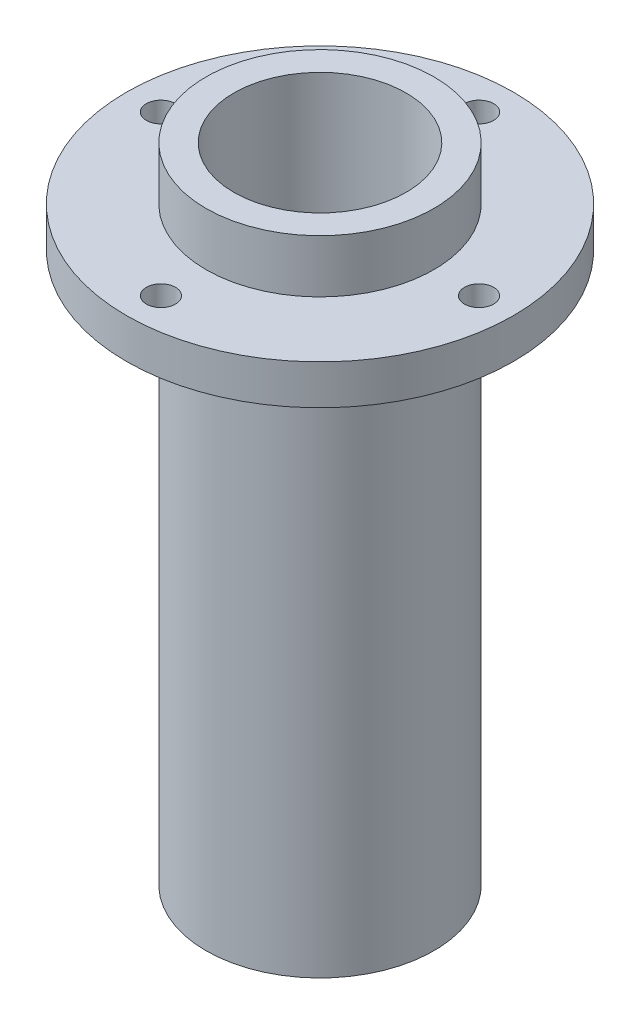
ISO-10303-21;
HEADER;
FILE_DESCRIPTION(('STEP AP214'),'2;1');
FILE_NAME('part.step','',(''),(''),'','','');
FILE_SCHEMA(('AUTOMOTIVE_DESIGN { 1 0 10303 214 1 1 1 1 }'));
ENDSEC;
DATA;
#1=APPLICATION_CONTEXT('core data for automotive mechanical design processes');
#2=APPLICATION_PROTOCOL_DEFINITION('international standard','automotive_design',2000,#1);
#3=PRODUCT_CONTEXT('',#1,'mechanical');
#4=PRODUCT('Part','Part','',(#3));
#5=PRODUCT_RELATED_PRODUCT_CATEGORY('part','',(#4));
#6=PRODUCT_DEFINITION_FORMATION('','',#4);
#7=PRODUCT_DEFINITION_CONTEXT('part definition',#1,'design');
#8=PRODUCT_DEFINITION('design','',#6,#7);
#9=PRODUCT_DEFINITION_SHAPE('','',#8);
#10=(LENGTH_UNIT() NAMED_UNIT(*) SI_UNIT(.MILLI.,.METRE.));
#11=(NAMED_UNIT(*) PLANE_ANGLE_UNIT() SI_UNIT($,.RADIAN.));
#12=(NAMED_UNIT(*) SI_UNIT($,.STERADIAN.) SOLID_ANGLE_UNIT());
#13=UNCERTAINTY_MEASURE_WITH_UNIT(LENGTH_MEASURE(1.E-05),#10,'distance_accuracy_value','');
#14=(GEOMETRIC_REPRESENTATION_CONTEXT(3) GLOBAL_UNCERTAINTY_ASSIGNED_CONTEXT((#13)) GLOBAL_UNIT_ASSIGNED_CONTEXT((#10,
#11,#12)) REPRESENTATION_CONTEXT('',''));
#15=CARTESIAN_POINT('',(0.,0.,0.));
#16=DIRECTION('',(0.,0.,1.));
#17=DIRECTION('',(1.,0.,0.));
#18=AXIS2_PLACEMENT_3D('',#15,#16,#17);
#19=CARTESIAN_POINT('',(0.,20.75,0.));
#20=DIRECTION('',(0.,1.,0.));
#21=DIRECTION('',(0.,0.,1.));
#22=AXIS2_PLACEMENT_3D('',#19,#20,#21);
#23=CYLINDRICAL_SURFACE('',#22,8.6);
#24=CARTESIAN_POINT('',(0.,16.75,0.));
#25=DIRECTION('',(0.,1.,0.));
#26=DIRECTION('',(0.,0.,1.));
#27=AXIS2_PLACEMENT_3D('',#24,#25,#26);
#28=CIRCLE('',#27,8.6);
#29=CARTESIAN_POINT('',(0.,16.75,8.6));
#30=VERTEX_POINT('',#29);
#31=EDGE_CURVE('E50',#30,#30,#28,.T.);
#32=ORIENTED_EDGE('',*,*,#31,.T.);
#33=EDGE_LOOP('',(#32));
#34=FACE_BOUND('',#33,.T.);
#35=CARTESIAN_POINT('',(0.,20.75,0.));
#36=DIRECTION('',(0.,1.,0.));
#37=DIRECTION('',(0.,0.,1.));
#38=AXIS2_PLACEMENT_3D('',#35,#36,#37);
#39=CIRCLE('',#38,8.6);
#40=CARTESIAN_POINT('',(0.,20.75,8.6));
#41=VERTEX_POINT('',#40);
#42=EDGE_CURVE('E77',#41,#41,#39,.T.);
#43=ORIENTED_EDGE('',*,*,#42,.F.);
#44=EDGE_LOOP('',(#43));
#45=FACE_BOUND('',#44,.T.);
#46=ADVANCED_FACE('F37',(#34,#45),#23,.T.);
#47=CARTESIAN_POINT('',(-14.6,16.75,0.));
#48=DIRECTION('',(0.,1.,0.));
#49=DIRECTION('',(0.,0.,1.));
#50=AXIS2_PLACEMENT_3D('',#47,#48,#49);
#51=PLANE('',#50);
#52=CARTESIAN_POINT('',(0.,16.75,-12.));
#53=DIRECTION('',(0.,1.,0.));
#54=DIRECTION('',(0.,0.,1.));
#55=AXIS2_PLACEMENT_3D('',#52,#53,#54);
#56=CIRCLE('',#55,1.1);
#57=CARTESIAN_POINT('',(0.,16.75,-10.9));
#58=VERTEX_POINT('',#57);
#59=EDGE_CURVE('E81',#58,#58,#56,.T.);
#60=ORIENTED_EDGE('',*,*,#59,.F.);
#61=EDGE_LOOP('',(#60));
#62=FACE_BOUND('',#61,.T.);
#63=CARTESIAN_POINT('',(12.0000000000008,16.75,-7.65792580530817E-13));
#64=DIRECTION('',(0.,1.,0.));
#65=DIRECTION('',(0.,0.,1.));
#66=AXIS2_PLACEMENT_3D('',#63,#64,#65);
#67=CIRCLE('',#66,1.1);
#68=CARTESIAN_POINT('',(12.0000000000008,16.75,1.09999999999924));
#69=VERTEX_POINT('',#68);
#70=EDGE_CURVE('E103',#69,#69,#67,.T.);
#71=ORIENTED_EDGE('',*,*,#70,.F.);
#72=EDGE_LOOP('',(#71));
#73=FACE_BOUND('',#72,.T.);
#74=CARTESIAN_POINT('',(1.53207728676303E-12,16.75,12.));
#75=DIRECTION('',(0.,1.,0.));
#76=DIRECTION('',(0.,0.,1.));
#77=AXIS2_PLACEMENT_3D('',#74,#75,#76);
#78=CIRCLE('',#77,1.1);
#79=CARTESIAN_POINT('',(1.53207728676303E-12,16.75,13.1));
#80=VERTEX_POINT('',#79);
#81=EDGE_CURVE('E95',#80,#80,#78,.T.);
#82=ORIENTED_EDGE('',*,*,#81,.F.);
#83=EDGE_LOOP('',(#82));
#84=FACE_BOUND('',#83,.T.);
#85=CARTESIAN_POINT('',(-11.9999999999992,16.75,7.67262156689794E-13));
#86=DIRECTION('',(0.,1.,0.));
#87=DIRECTION('',(0.,0.,1.));
#88=AXIS2_PLACEMENT_3D('',#85,#86,#87);
#89=CIRCLE('',#88,1.1);
#90=CARTESIAN_POINT('',(-11.9999999999992,16.75,1.10000000000077));
#91=VERTEX_POINT('',#90);
#92=EDGE_CURVE('E86',#91,#91,#89,.T.);
#93=ORIENTED_EDGE('',*,*,#92,.F.);
#94=EDGE_LOOP('',(#93));
#95=FACE_BOUND('',#94,.T.);
#96=CARTESIAN_POINT('',(0.,16.75,0.));
#97=DIRECTION('',(0.,1.,0.));
#98=DIRECTION('',(0.,0.,1.));
#99=AXIS2_PLACEMENT_3D('',#96,#97,#98);
#100=CIRCLE('',#99,14.6);
#101=CARTESIAN_POINT('',(0.,16.75,14.6));
#102=VERTEX_POINT('',#101);
#103=EDGE_CURVE('E55',#102,#102,#100,.T.);
#104=ORIENTED_EDGE('',*,*,#103,.T.);
#105=EDGE_LOOP('',(#104));
#106=FACE_BOUND('',#105,.T.);
#107=ORIENTED_EDGE('',*,*,#31,.F.);
#108=EDGE_LOOP('',(#107));
#109=FACE_BOUND('',#108,.T.);
#110=ADVANCED_FACE('F139',(#62,#73,#84,#95,#106,#109),#51,.T.);
#111=CARTESIAN_POINT('',(0.,20.75,0.));
#112=DIRECTION('',(0.,1.,0.));
#113=DIRECTION('',(0.,0.,1.));
#114=AXIS2_PLACEMENT_3D('',#111,#112,#113);
#115=CYLINDRICAL_SURFACE('',#114,14.6);
#116=CARTESIAN_POINT('',(0.,13.75,0.));
#117=DIRECTION('',(0.,1.,0.));
#118=DIRECTION('',(0.,0.,1.));
#119=AXIS2_PLACEMENT_3D('',#116,#117,#118);
#120=CIRCLE('',#119,14.6);
#121=CARTESIAN_POINT('',(0.,13.75,14.6));
#122=VERTEX_POINT('',#121);
#123=EDGE_CURVE('E61',#122,#122,#120,.T.);
#124=ORIENTED_EDGE('',*,*,#123,.T.);
#125=EDGE_LOOP('',(#124));
#126=FACE_BOUND('',#125,.T.);
#127=ORIENTED_EDGE('',*,*,#103,.F.);
#128=EDGE_LOOP('',(#127));
#129=FACE_BOUND('',#128,.T.);
#130=ADVANCED_FACE('F144',(#126,#129),#115,.T.);
#131=CARTESIAN_POINT('',(-14.6,13.75,0.));
#132=DIRECTION('',(0.,-1.,0.));
#133=DIRECTION('',(0.,0.,-1.));
#134=AXIS2_PLACEMENT_3D('',#131,#132,#133);
#135=PLANE('',#134);
#136=CARTESIAN_POINT('',(0.,13.75,-12.));
#137=DIRECTION('',(0.,-1.,0.));
#138=DIRECTION('',(0.,0.,-1.));
#139=AXIS2_PLACEMENT_3D('',#136,#137,#138);
#140=CIRCLE('',#139,1.1);
#141=CARTESIAN_POINT('',(0.,13.75,-13.1));
#142=VERTEX_POINT('',#141);
#143=EDGE_CURVE('E107',#142,#142,#140,.F.);
#144=ORIENTED_EDGE('',*,*,#143,.T.);
#145=EDGE_LOOP('',(#144));
#146=FACE_BOUND('',#145,.T.);
#147=CARTESIAN_POINT('',(12.0000000000008,13.75,-7.65792580530817E-13));
#148=DIRECTION('',(0.,-1.,0.));
#149=DIRECTION('',(0.,0.,-1.));
#150=AXIS2_PLACEMENT_3D('',#147,#148,#149);
#151=CIRCLE('',#150,1.1);
#152=CARTESIAN_POINT('',(12.0000000000008,13.75,-1.10000000000077));
#153=VERTEX_POINT('',#152);
#154=EDGE_CURVE('E99',#153,#153,#151,.F.);
#155=ORIENTED_EDGE('',*,*,#154,.T.);
#156=EDGE_LOOP('',(#155));
#157=FACE_BOUND('',#156,.T.);
#158=CARTESIAN_POINT('',(1.53207728676303E-12,13.75,12.));
#159=DIRECTION('',(0.,-1.,0.));
#160=DIRECTION('',(0.,0.,-1.));
#161=AXIS2_PLACEMENT_3D('',#158,#159,#160);
#162=CIRCLE('',#161,1.1);
#163=CARTESIAN_POINT('',(1.53207728676303E-12,13.75,10.9));
#164=VERTEX_POINT('',#163);
#165=EDGE_CURVE('E91',#164,#164,#162,.F.);
#166=ORIENTED_EDGE('',*,*,#165,.T.);
#167=EDGE_LOOP('',(#166));
#168=FACE_BOUND('',#167,.T.);
#169=CARTESIAN_POINT('',(-11.9999999999992,13.75,7.67262156689794E-13));
#170=DIRECTION('',(0.,-1.,0.));
#171=DIRECTION('',(0.,0.,-1.));
#172=AXIS2_PLACEMENT_3D('',#169,#170,#171);
#173=CIRCLE('',#172,1.1);
#174=CARTESIAN_POINT('',(-11.9999999999992,13.75,-1.09999999999923));
#175=VERTEX_POINT('',#174);
#176=EDGE_CURVE('E82',#175,#175,#173,.F.);
#177=ORIENTED_EDGE('',*,*,#176,.T.);
#178=EDGE_LOOP('',(#177));
#179=FACE_BOUND('',#178,.T.);
#180=CARTESIAN_POINT('',(0.,13.75,0.));
#181=DIRECTION('',(0.,1.,0.));
#182=DIRECTION('',(0.,0.,1.));
#183=AXIS2_PLACEMENT_3D('',#180,#181,#182);
#184=CIRCLE('',#183,8.6);
#185=CARTESIAN_POINT('',(0.,13.75,8.6));
#186=VERTEX_POINT('',#185);
#187=EDGE_CURVE('E65',#186,#186,#184,.T.);
#188=ORIENTED_EDGE('',*,*,#187,.T.);
#189=EDGE_LOOP('',(#188));
#190=FACE_BOUND('',#189,.T.);
#191=ORIENTED_EDGE('',*,*,#123,.F.);
#192=EDGE_LOOP('',(#191));
#193=FACE_BOUND('',#192,.T.);
#194=ADVANCED_FACE('F150',(#146,#157,#168,#179,#190,#193),#135,.T.);
#195=CARTESIAN_POINT('',(0.,20.75,0.));
#196=DIRECTION('',(0.,1.,0.));
#197=DIRECTION('',(0.,0.,1.));
#198=AXIS2_PLACEMENT_3D('',#195,#196,#197);
#199=CYLINDRICAL_SURFACE('',#198,8.6);
#200=CARTESIAN_POINT('',(0.,-27.75,0.));
#201=DIRECTION('',(0.,1.,0.));
#202=DIRECTION('',(0.,0.,1.));
#203=AXIS2_PLACEMENT_3D('',#200,#201,#202);
#204=CIRCLE('',#203,8.6);
#205=CARTESIAN_POINT('',(0.,-27.75,8.6));
#206=VERTEX_POINT('',#205);
#207=EDGE_CURVE('E69',#206,#206,#204,.T.);
#208=ORIENTED_EDGE('',*,*,#207,.T.);
#209=EDGE_LOOP('',(#208));
#210=FACE_BOUND('',#209,.T.);
#211=ORIENTED_EDGE('',*,*,#187,.F.);
#212=EDGE_LOOP('',(#211));
#213=FACE_BOUND('',#212,.T.);
#214=ADVANCED_FACE('F154',(#210,#213),#199,.T.);
#215=CARTESIAN_POINT('',(-6.6,-27.75,0.));
#216=DIRECTION('',(0.,-1.,0.));
#217=DIRECTION('',(0.,0.,-1.));
#218=AXIS2_PLACEMENT_3D('',#215,#216,#217);
#219=PLANE('',#218);
#220=CARTESIAN_POINT('',(0.,-27.75,0.));
#221=DIRECTION('',(0.,-1.,0.));
#222=DIRECTION('',(0.,0.,-1.));
#223=AXIS2_PLACEMENT_3D('',#220,#221,#222);
#224=CIRCLE('',#223,7.1);
#225=CARTESIAN_POINT('',(0.,-27.75,-7.1));
#226=VERTEX_POINT('',#225);
#227=EDGE_CURVE('E45',#226,#226,#224,.F.);
#228=ORIENTED_EDGE('',*,*,#227,.T.);
#229=EDGE_LOOP('',(#228));
#230=FACE_BOUND('',#229,.T.);
#231=ORIENTED_EDGE('',*,*,#207,.F.);
#232=EDGE_LOOP('',(#231));
#233=FACE_BOUND('',#232,.T.);
#234=ADVANCED_FACE('F158',(#230,#233),#219,.T.);
#235=CARTESIAN_POINT('',(0.,20.75,0.));
#236=DIRECTION('',(0.,1.,0.));
#237=DIRECTION('',(0.,0.,1.));
#238=AXIS2_PLACEMENT_3D('',#235,#236,#237);
#239=CYLINDRICAL_SURFACE('',#238,6.6);
#240=CARTESIAN_POINT('',(0.,-27.25,0.));
#241=DIRECTION('',(0.,-1.,0.));
#242=DIRECTION('',(0.,0.,-1.));
#243=AXIS2_PLACEMENT_3D('',#240,#241,#242);
#244=CIRCLE('',#243,6.6);
#245=CARTESIAN_POINT('',(0.,-27.25,-6.6));
#246=VERTEX_POINT('',#245);
#247=EDGE_CURVE('E10',#246,#246,#244,.T.);
#248=ORIENTED_EDGE('',*,*,#247,.T.);
#249=EDGE_LOOP('',(#248));
#250=FACE_BOUND('',#249,.T.);
#251=CARTESIAN_POINT('',(0.,-20.75,0.));
#252=DIRECTION('',(0.,1.,0.));
#253=DIRECTION('',(0.,0.,1.));
#254=AXIS2_PLACEMENT_3D('',#251,#252,#253);
#255=CIRCLE('',#254,6.6);
#256=CARTESIAN_POINT('',(0.,-20.75,6.6));
#257=VERTEX_POINT('',#256);
#258=EDGE_CURVE('E73',#257,#257,#255,.T.);
#259=ORIENTED_EDGE('',*,*,#258,.T.);
#260=EDGE_LOOP('',(#259));
#261=FACE_BOUND('',#260,.T.);
#262=ADVANCED_FACE('F162',(#250,#261),#239,.F.);
#263=CARTESIAN_POINT('',(0.,-20.75,0.));
#264=DIRECTION('',(0.,-1.,0.));
#265=DIRECTION('',(0.,0.,-1.));
#266=AXIS2_PLACEMENT_3D('',#263,#264,#265);
#267=PLANE('',#266);
#268=ORIENTED_EDGE('',*,*,#258,.F.);
#269=EDGE_LOOP('',(#268));
#270=FACE_BOUND('',#269,.T.);
#271=ADVANCED_FACE('F134',(#270),#267,.T.);
#272=CARTESIAN_POINT('',(-8.6,20.75,0.));
#273=DIRECTION('',(0.,1.,0.));
#274=DIRECTION('',(0.,0.,1.));
#275=AXIS2_PLACEMENT_3D('',#272,#273,#274);
#276=PLANE('',#275);
#277=CARTESIAN_POINT('',(0.,20.75,0.));
#278=DIRECTION('',(0.,1.,0.));
#279=DIRECTION('',(0.,0.,1.));
#280=AXIS2_PLACEMENT_3D('',#277,#278,#279);
#281=CIRCLE('',#280,6.5);
#282=CARTESIAN_POINT('',(0.,20.75,6.5));
#283=VERTEX_POINT('',#282);
#284=EDGE_CURVE('E114',#283,#283,#281,.T.);
#285=ORIENTED_EDGE('',*,*,#284,.F.);
#286=EDGE_LOOP('',(#285));
#287=FACE_BOUND('',#286,.T.);
#288=ORIENTED_EDGE('',*,*,#42,.T.);
#289=EDGE_LOOP('',(#288));
#290=FACE_BOUND('',#289,.T.);
#291=ADVANCED_FACE('F131',(#287,#290),#276,.T.);
#292=CARTESIAN_POINT('',(0.,-27.75,0.));
#293=DIRECTION('',(0.,-1.,0.));
#294=DIRECTION('',(0.,0.,-1.));
#295=AXIS2_PLACEMENT_3D('',#292,#293,#294);
#296=CONICAL_SURFACE('',#295,7.1,0.785398163397444);
#297=ORIENTED_EDGE('',*,*,#247,.F.);
#298=EDGE_LOOP('',(#297));
#299=FACE_BOUND('',#298,.T.);
#300=ORIENTED_EDGE('',*,*,#227,.F.);
#301=EDGE_LOOP('',(#300));
#302=FACE_BOUND('',#301,.T.);
#303=ADVANCED_FACE('F39',(#299,#302),#296,.F.);
#304=CARTESIAN_POINT('',(-11.9999999999992,-27.751,7.67262156689794E-13));
#305=DIRECTION('',(0.,1.,0.));
#306=DIRECTION('',(0.,0.,1.));
#307=AXIS2_PLACEMENT_3D('',#304,#305,#306);
#308=CYLINDRICAL_SURFACE('',#307,1.1);
#309=ORIENTED_EDGE('',*,*,#176,.F.);
#310=EDGE_LOOP('',(#309));
#311=FACE_BOUND('',#310,.T.);
#312=ORIENTED_EDGE('',*,*,#92,.T.);
#313=EDGE_LOOP('',(#312));
#314=FACE_BOUND('',#313,.T.);
#315=ADVANCED_FACE('F168',(#311,#314),#308,.F.);
#316=CARTESIAN_POINT('',(1.53207728676303E-12,-27.751,12.));
#317=DIRECTION('',(0.,1.,0.));
#318=DIRECTION('',(0.,0.,1.));
#319=AXIS2_PLACEMENT_3D('',#316,#317,#318);
#320=CYLINDRICAL_SURFACE('',#319,1.1);
#321=ORIENTED_EDGE('',*,*,#165,.F.);
#322=EDGE_LOOP('',(#321));
#323=FACE_BOUND('',#322,.T.);
#324=ORIENTED_EDGE('',*,*,#81,.T.);
#325=EDGE_LOOP('',(#324));
#326=FACE_BOUND('',#325,.T.);
#327=ADVANCED_FACE('F171',(#323,#326),#320,.F.);
#328=CARTESIAN_POINT('',(12.0000000000008,-27.751,-7.65792580530817E-13));
#329=DIRECTION('',(0.,1.,0.));
#330=DIRECTION('',(0.,0.,1.));
#331=AXIS2_PLACEMENT_3D('',#328,#329,#330);
#332=CYLINDRICAL_SURFACE('',#331,1.1);
#333=ORIENTED_EDGE('',*,*,#154,.F.);
#334=EDGE_LOOP('',(#333));
#335=FACE_BOUND('',#334,.T.);
#336=ORIENTED_EDGE('',*,*,#70,.T.);
#337=EDGE_LOOP('',(#336));
#338=FACE_BOUND('',#337,.T.);
#339=ADVANCED_FACE('F175',(#335,#338),#332,.F.);
#340=CARTESIAN_POINT('',(0.,-27.751,-12.));
#341=DIRECTION('',(0.,1.,0.));
#342=DIRECTION('',(0.,0.,1.));
#343=AXIS2_PLACEMENT_3D('',#340,#341,#342);
#344=CYLINDRICAL_SURFACE('',#343,1.1);
#345=ORIENTED_EDGE('',*,*,#143,.F.);
#346=EDGE_LOOP('',(#345));
#347=FACE_BOUND('',#346,.T.);
#348=ORIENTED_EDGE('',*,*,#59,.T.);
#349=EDGE_LOOP('',(#348));
#350=FACE_BOUND('',#349,.T.);
#351=ADVANCED_FACE('F127',(#347,#350),#344,.F.);
#352=CARTESIAN_POINT('',(0.,-17.25,0.));
#353=DIRECTION('',(0.,1.,0.));
#354=DIRECTION('',(0.,0.,1.));
#355=AXIS2_PLACEMENT_3D('',#352,#353,#354);
#356=CYLINDRICAL_SURFACE('',#355,6.5);
#357=CARTESIAN_POINT('',(0.,-17.25,0.));
#358=DIRECTION('',(0.,1.,0.));
#359=DIRECTION('',(0.,0.,1.));
#360=AXIS2_PLACEMENT_3D('',#357,#358,#359);
#361=CIRCLE('',#360,6.5);
#362=CARTESIAN_POINT('',(0.,-17.25,6.5));
#363=VERTEX_POINT('',#362);
#364=EDGE_CURVE('E87',#363,#363,#361,.T.);
#365=ORIENTED_EDGE('',*,*,#364,.F.);
#366=EDGE_LOOP('',(#365));
#367=FACE_BOUND('',#366,.T.);
#368=ORIENTED_EDGE('',*,*,#284,.T.);
#369=EDGE_LOOP('',(#368));
#370=FACE_BOUND('',#369,.T.);
#371=ADVANCED_FACE('F124',(#367,#370),#356,.F.);
#372=CARTESIAN_POINT('',(0.,-17.25,0.));
#373=DIRECTION('',(0.,1.,0.));
#374=DIRECTION('',(0.,0.,1.));
#375=AXIS2_PLACEMENT_3D('',#372,#373,#374);
#376=PLANE('',#375);
#377=ORIENTED_EDGE('',*,*,#364,.T.);
#378=EDGE_LOOP('',(#377));
#379=FACE_BOUND('',#378,.T.);
#380=ADVANCED_FACE('F122',(#379),#376,.T.);
#381=CLOSED_SHELL('',(#46,#110,#130,#194,#214,#234,#262,#271,#291,#303,#315,#327,#339,#351,#371,#380));
#382=MANIFOLD_SOLID_BREP('B2',#381);
#383=ADVANCED_BREP_SHAPE_REPRESENTATION('',(#18,#382),#14);
#384=SHAPE_DEFINITION_REPRESENTATION(#9,#383);
ENDSEC;
END-ISO-10303-21;
